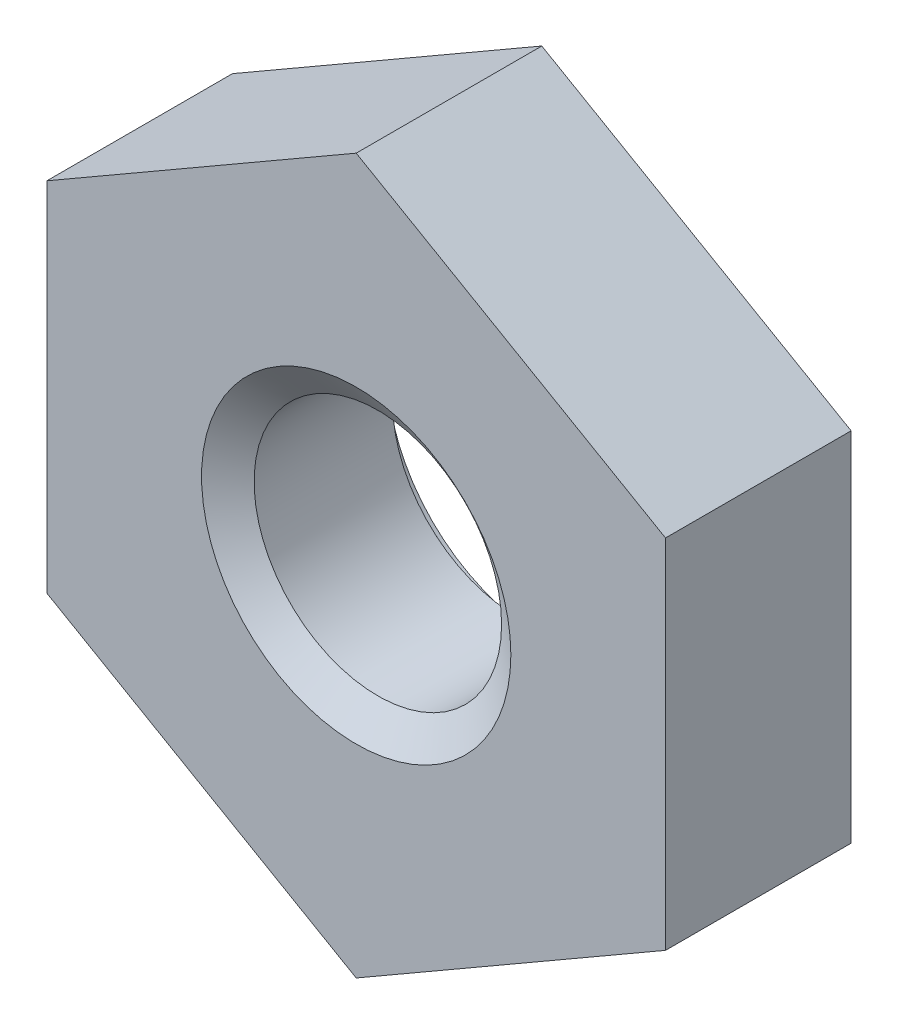
ISO-10303-21;
HEADER;
FILE_DESCRIPTION(('STEP AP214'),'2;1');
FILE_NAME('part.step','',(''),(''),'','','');
FILE_SCHEMA(('AUTOMOTIVE_DESIGN { 1 0 10303 214 1 1 1 1 }'));
ENDSEC;
DATA;
#1=APPLICATION_CONTEXT('core data for automotive mechanical design processes');
#2=APPLICATION_PROTOCOL_DEFINITION('international standard','automotive_design',2000,#1);
#3=PRODUCT_CONTEXT('',#1,'mechanical');
#4=PRODUCT('Part','Part','',(#3));
#5=PRODUCT_RELATED_PRODUCT_CATEGORY('part','',(#4));
#6=PRODUCT_DEFINITION_FORMATION('','',#4);
#7=PRODUCT_DEFINITION_CONTEXT('part definition',#1,'design');
#8=PRODUCT_DEFINITION('design','',#6,#7);
#9=PRODUCT_DEFINITION_SHAPE('','',#8);
#10=(LENGTH_UNIT() NAMED_UNIT(*) SI_UNIT(.MILLI.,.METRE.));
#11=(NAMED_UNIT(*) PLANE_ANGLE_UNIT() SI_UNIT($,.RADIAN.));
#12=(NAMED_UNIT(*) SI_UNIT($,.STERADIAN.) SOLID_ANGLE_UNIT());
#13=UNCERTAINTY_MEASURE_WITH_UNIT(LENGTH_MEASURE(1.E-05),#10,'distance_accuracy_value','');
#14=(GEOMETRIC_REPRESENTATION_CONTEXT(3) GLOBAL_UNCERTAINTY_ASSIGNED_CONTEXT((#13)) GLOBAL_UNIT_ASSIGNED_CONTEXT((#10,
#11,#12)) REPRESENTATION_CONTEXT('',''));
#15=CARTESIAN_POINT('',(0.,0.,0.));
#16=DIRECTION('',(0.,0.,1.));
#17=DIRECTION('',(1.,0.,0.));
#18=AXIS2_PLACEMENT_3D('',#15,#16,#17);
#19=CARTESIAN_POINT('',(0.,0.,-1.2));
#20=DIRECTION('',(0.,0.,1.));
#21=DIRECTION('',(1.,0.,0.));
#22=AXIS2_PLACEMENT_3D('',#19,#20,#21);
#23=CYLINDRICAL_SURFACE('',#22,0.8);
#24=CARTESIAN_POINT('',(0.,0.,-0.140041507641936));
#25=DIRECTION('',(0.,0.,1.));
#26=DIRECTION('',(1.,0.,0.));
#27=AXIS2_PLACEMENT_3D('',#24,#25,#26);
#28=CIRCLE('',#27,0.8);
#29=CARTESIAN_POINT('',(0.8,0.,-0.140041507641936));
#30=VERTEX_POINT('',#29);
#31=EDGE_CURVE('E107',#30,#30,#28,.F.);
#32=ORIENTED_EDGE('',*,*,#31,.F.);
#33=EDGE_LOOP('',(#32));
#34=FACE_BOUND('',#33,.T.);
#35=CARTESIAN_POINT('',(0.,0.,-1.03455849235806));
#36=DIRECTION('',(0.,0.,-1.));
#37=DIRECTION('',(-1.,0.,0.));
#38=AXIS2_PLACEMENT_3D('',#35,#36,#37);
#39=CIRCLE('',#38,0.8);
#40=CARTESIAN_POINT('',(-0.8,0.,-1.03455849235806));
#41=VERTEX_POINT('',#40);
#42=EDGE_CURVE('E36',#41,#41,#39,.F.);
#43=ORIENTED_EDGE('',*,*,#42,.F.);
#44=EDGE_LOOP('',(#43));
#45=FACE_BOUND('',#44,.T.);
#46=ADVANCED_FACE('F32',(#34,#45),#23,.F.);
#47=CARTESIAN_POINT('',(0.,2.30940107675852,-1.2));
#48=DIRECTION('',(0.,0.,-1.));
#49=DIRECTION('',(-1.,0.,0.));
#50=AXIS2_PLACEMENT_3D('',#47,#48,#49);
#51=PLANE('',#50);
#52=DIRECTION('',(-0.86602540378443,-0.500000000000015,0.));
#53=VECTOR('',#52,1.);
#54=CARTESIAN_POINT('',(0.,2.30940107675852,-1.2));
#55=LINE('',#54,#53);
#56=CARTESIAN_POINT('',(0.,2.30940107675852,-1.2));
#57=VERTEX_POINT('',#56);
#58=CARTESIAN_POINT('',(-2.,1.15470053837922,-1.2));
#59=VERTEX_POINT('',#58);
#60=EDGE_CURVE('E88',#57,#59,#55,.T.);
#61=ORIENTED_EDGE('',*,*,#60,.F.);
#62=DIRECTION('',(-0.866025403784437,0.500000000000003,0.));
#63=VECTOR('',#62,1.);
#64=CARTESIAN_POINT('',(2.00000000000001,1.15470053837925,-1.2));
#65=LINE('',#64,#63);
#66=CARTESIAN_POINT('',(2.00000000000001,1.15470053837925,-1.2));
#67=VERTEX_POINT('',#66);
#68=EDGE_CURVE('E93',#67,#57,#65,.T.);
#69=ORIENTED_EDGE('',*,*,#68,.F.);
#70=DIRECTION('',(0.,-1.,0.));
#71=VECTOR('',#70,1.);
#72=CARTESIAN_POINT('',(2.00000000000001,1.15470053837925,-1.2));
#73=LINE('',#72,#71);
#74=CARTESIAN_POINT('',(2.00000000000001,-1.15470053837927,-1.2));
#75=VERTEX_POINT('',#74);
#76=EDGE_CURVE('E132',#67,#75,#73,.T.);
#77=ORIENTED_EDGE('',*,*,#76,.T.);
#78=DIRECTION('',(0.86602540378443,0.500000000000014,0.));
#79=VECTOR('',#78,1.);
#80=CARTESIAN_POINT('',(0.,-2.30940107675856,-1.2));
#81=LINE('',#80,#79);
#82=CARTESIAN_POINT('',(0.,-2.30940107675856,-1.2));
#83=VERTEX_POINT('',#82);
#84=EDGE_CURVE('E129',#83,#75,#81,.T.);
#85=ORIENTED_EDGE('',*,*,#84,.F.);
#86=DIRECTION('',(0.866025403784438,-0.500000000000001,0.));
#87=VECTOR('',#86,1.);
#88=CARTESIAN_POINT('',(-2.,-1.1547005383793,-1.2));
#89=LINE('',#88,#87);
#90=CARTESIAN_POINT('',(-2.,-1.1547005383793,-1.2));
#91=VERTEX_POINT('',#90);
#92=EDGE_CURVE('E126',#91,#83,#89,.T.);
#93=ORIENTED_EDGE('',*,*,#92,.F.);
#94=DIRECTION('',(0.,-1.,0.));
#95=VECTOR('',#94,1.);
#96=CARTESIAN_POINT('',(-2.,1.15470053837922,-1.2));
#97=LINE('',#96,#95);
#98=EDGE_CURVE('E124',#59,#91,#97,.T.);
#99=ORIENTED_EDGE('',*,*,#98,.F.);
#100=EDGE_LOOP('',(#61,#69,#77,#85,#93,#99));
#101=FACE_BOUND('',#100,.T.);
#102=CARTESIAN_POINT('',(0.,0.,-1.2));
#103=DIRECTION('',(0.,0.,-1.));
#104=DIRECTION('',(-1.,0.,0.));
#105=AXIS2_PLACEMENT_3D('',#102,#103,#104);
#106=CIRCLE('',#105,0.999999999999999);
#107=CARTESIAN_POINT('',(-0.999999999999999,0.,-1.2));
#108=VERTEX_POINT('',#107);
#109=EDGE_CURVE('E140',#108,#108,#106,.F.);
#110=ORIENTED_EDGE('',*,*,#109,.T.);
#111=EDGE_LOOP('',(#110));
#112=FACE_BOUND('',#111,.T.);
#113=ADVANCED_FACE('F159',(#101,#112),#51,.T.);
#114=CARTESIAN_POINT('',(0.,2.30940107675852,0.));
#115=DIRECTION('',(0.,0.,-1.));
#116=DIRECTION('',(-1.,0.,0.));
#117=AXIS2_PLACEMENT_3D('',#114,#115,#116);
#118=PLANE('',#117);
#119=DIRECTION('',(-0.86602540378443,-0.500000000000015,0.));
#120=VECTOR('',#119,1.);
#121=CARTESIAN_POINT('',(0.,2.30940107675852,0.));
#122=LINE('',#121,#120);
#123=CARTESIAN_POINT('',(0.,2.30940107675852,0.));
#124=VERTEX_POINT('',#123);
#125=CARTESIAN_POINT('',(-2.,1.15470053837922,0.));
#126=VERTEX_POINT('',#125);
#127=EDGE_CURVE('E86',#124,#126,#122,.T.);
#128=ORIENTED_EDGE('',*,*,#127,.T.);
#129=DIRECTION('',(0.,-1.,0.));
#130=VECTOR('',#129,1.);
#131=CARTESIAN_POINT('',(-2.,1.15470053837922,0.));
#132=LINE('',#131,#130);
#133=CARTESIAN_POINT('',(-2.,-1.1547005383793,0.));
#134=VERTEX_POINT('',#133);
#135=EDGE_CURVE('E96',#126,#134,#132,.T.);
#136=ORIENTED_EDGE('',*,*,#135,.T.);
#137=DIRECTION('',(0.866025403784438,-0.500000000000001,0.));
#138=VECTOR('',#137,1.);
#139=CARTESIAN_POINT('',(-2.,-1.1547005383793,0.));
#140=LINE('',#139,#138);
#141=CARTESIAN_POINT('',(0.,-2.30940107675856,0.));
#142=VERTEX_POINT('',#141);
#143=EDGE_CURVE('E101',#134,#142,#140,.T.);
#144=ORIENTED_EDGE('',*,*,#143,.T.);
#145=DIRECTION('',(0.86602540378443,0.500000000000014,0.));
#146=VECTOR('',#145,1.);
#147=CARTESIAN_POINT('',(0.,-2.30940107675856,0.));
#148=LINE('',#147,#146);
#149=CARTESIAN_POINT('',(2.00000000000001,-1.15470053837927,0.));
#150=VERTEX_POINT('',#149);
#151=EDGE_CURVE('E116',#142,#150,#148,.T.);
#152=ORIENTED_EDGE('',*,*,#151,.T.);
#153=DIRECTION('',(0.,-1.,0.));
#154=VECTOR('',#153,1.);
#155=CARTESIAN_POINT('',(2.00000000000001,1.15470053837925,0.));
#156=LINE('',#155,#154);
#157=CARTESIAN_POINT('',(2.00000000000001,1.15470053837925,0.));
#158=VERTEX_POINT('',#157);
#159=EDGE_CURVE('E119',#158,#150,#156,.T.);
#160=ORIENTED_EDGE('',*,*,#159,.F.);
#161=DIRECTION('',(-0.866025403784437,0.500000000000003,0.));
#162=VECTOR('',#161,1.);
#163=CARTESIAN_POINT('',(2.00000000000001,1.15470053837925,0.));
#164=LINE('',#163,#162);
#165=EDGE_CURVE('E106',#158,#124,#164,.T.);
#166=ORIENTED_EDGE('',*,*,#165,.T.);
#167=EDGE_LOOP('',(#128,#136,#144,#152,#160,#166));
#168=FACE_BOUND('',#167,.T.);
#169=CARTESIAN_POINT('',(0.,0.,0.));
#170=DIRECTION('',(0.,0.,1.));
#171=DIRECTION('',(1.,0.,0.));
#172=AXIS2_PLACEMENT_3D('',#169,#170,#171);
#173=CIRCLE('',#172,0.999999999999999);
#174=CARTESIAN_POINT('',(0.999999999999999,0.,0.));
#175=VERTEX_POINT('',#174);
#176=EDGE_CURVE('E110',#175,#175,#173,.T.);
#177=ORIENTED_EDGE('',*,*,#176,.F.);
#178=EDGE_LOOP('',(#177));
#179=FACE_BOUND('',#178,.T.);
#180=ADVANCED_FACE('F103',(#168,#179),#118,.F.);
#181=CARTESIAN_POINT('',(0.,2.30940107675852,-1.2));
#182=DIRECTION('',(-0.500000000000015,0.86602540378443,0.));
#183=DIRECTION('',(-0.86602540378443,-0.500000000000015,0.));
#184=AXIS2_PLACEMENT_3D('',#181,#182,#183);
#185=PLANE('',#184);
#186=ORIENTED_EDGE('',*,*,#127,.F.);
#187=DIRECTION('',(0.,0.,1.));
#188=VECTOR('',#187,1.);
#189=CARTESIAN_POINT('',(0.,2.30940107675852,-1.2));
#190=LINE('',#189,#188);
#191=EDGE_CURVE('E11',#57,#124,#190,.T.);
#192=ORIENTED_EDGE('',*,*,#191,.F.);
#193=ORIENTED_EDGE('',*,*,#60,.T.);
#194=DIRECTION('',(0.,0.,1.));
#195=VECTOR('',#194,1.);
#196=CARTESIAN_POINT('',(-2.,1.15470053837922,-1.2));
#197=LINE('',#196,#195);
#198=EDGE_CURVE('E83',#59,#126,#197,.T.);
#199=ORIENTED_EDGE('',*,*,#198,.T.);
#200=EDGE_LOOP('',(#186,#192,#193,#199));
#201=FACE_BOUND('',#200,.T.);
#202=ADVANCED_FACE('F34',(#201),#185,.T.);
#203=CARTESIAN_POINT('',(2.00000000000001,1.15470053837925,-1.2));
#204=DIRECTION('',(0.500000000000003,0.866025403784437,0.));
#205=DIRECTION('',(-0.866025403784437,0.500000000000003,0.));
#206=AXIS2_PLACEMENT_3D('',#203,#204,#205);
#207=PLANE('',#206);
#208=ORIENTED_EDGE('',*,*,#165,.F.);
#209=DIRECTION('',(0.,0.,1.));
#210=VECTOR('',#209,1.);
#211=CARTESIAN_POINT('',(2.00000000000001,1.15470053837925,-1.2));
#212=LINE('',#211,#210);
#213=EDGE_CURVE('E41',#67,#158,#212,.T.);
#214=ORIENTED_EDGE('',*,*,#213,.F.);
#215=ORIENTED_EDGE('',*,*,#68,.T.);
#216=ORIENTED_EDGE('',*,*,#191,.T.);
#217=EDGE_LOOP('',(#208,#214,#215,#216));
#218=FACE_BOUND('',#217,.T.);
#219=ADVANCED_FACE('F173',(#218),#207,.T.);
#220=CARTESIAN_POINT('',(2.00000000000001,1.15470053837925,-1.2));
#221=DIRECTION('',(-1.,0.,0.));
#222=DIRECTION('',(0.,0.,1.));
#223=AXIS2_PLACEMENT_3D('',#220,#221,#222);
#224=PLANE('',#223);
#225=ORIENTED_EDGE('',*,*,#159,.T.);
#226=DIRECTION('',(0.,0.,1.));
#227=VECTOR('',#226,1.);
#228=CARTESIAN_POINT('',(2.00000000000001,-1.15470053837927,-1.2));
#229=LINE('',#228,#227);
#230=EDGE_CURVE('E136',#75,#150,#229,.T.);
#231=ORIENTED_EDGE('',*,*,#230,.F.);
#232=ORIENTED_EDGE('',*,*,#76,.F.);
#233=ORIENTED_EDGE('',*,*,#213,.T.);
#234=EDGE_LOOP('',(#225,#231,#232,#233));
#235=FACE_BOUND('',#234,.T.);
#236=ADVANCED_FACE('F176',(#235),#224,.F.);
#237=CARTESIAN_POINT('',(0.,-2.30940107675856,-1.2));
#238=DIRECTION('',(0.500000000000014,-0.86602540378443,0.));
#239=DIRECTION('',(0.86602540378443,0.500000000000014,0.));
#240=AXIS2_PLACEMENT_3D('',#237,#238,#239);
#241=PLANE('',#240);
#242=ORIENTED_EDGE('',*,*,#151,.F.);
#243=DIRECTION('',(0.,0.,1.));
#244=VECTOR('',#243,1.);
#245=CARTESIAN_POINT('',(0.,-2.30940107675856,-1.2));
#246=LINE('',#245,#244);
#247=EDGE_CURVE('E138',#83,#142,#246,.T.);
#248=ORIENTED_EDGE('',*,*,#247,.F.);
#249=ORIENTED_EDGE('',*,*,#84,.T.);
#250=ORIENTED_EDGE('',*,*,#230,.T.);
#251=EDGE_LOOP('',(#242,#248,#249,#250));
#252=FACE_BOUND('',#251,.T.);
#253=ADVANCED_FACE('F179',(#252),#241,.T.);
#254=CARTESIAN_POINT('',(-2.,-1.1547005383793,-1.2));
#255=DIRECTION('',(-0.500000000000001,-0.866025403784438,0.));
#256=DIRECTION('',(0.866025403784438,-0.500000000000001,0.));
#257=AXIS2_PLACEMENT_3D('',#254,#255,#256);
#258=PLANE('',#257);
#259=ORIENTED_EDGE('',*,*,#143,.F.);
#260=DIRECTION('',(0.,0.,1.));
#261=VECTOR('',#260,1.);
#262=CARTESIAN_POINT('',(-2.,-1.1547005383793,-1.2));
#263=LINE('',#262,#261);
#264=EDGE_CURVE('E92',#91,#134,#263,.T.);
#265=ORIENTED_EDGE('',*,*,#264,.F.);
#266=ORIENTED_EDGE('',*,*,#92,.T.);
#267=ORIENTED_EDGE('',*,*,#247,.T.);
#268=EDGE_LOOP('',(#259,#265,#266,#267));
#269=FACE_BOUND('',#268,.T.);
#270=ADVANCED_FACE('F183',(#269),#258,.T.);
#271=CARTESIAN_POINT('',(-2.,1.15470053837922,-1.2));
#272=DIRECTION('',(-1.,0.,0.));
#273=DIRECTION('',(0.,0.,1.));
#274=AXIS2_PLACEMENT_3D('',#271,#272,#273);
#275=PLANE('',#274);
#276=ORIENTED_EDGE('',*,*,#135,.F.);
#277=ORIENTED_EDGE('',*,*,#198,.F.);
#278=ORIENTED_EDGE('',*,*,#98,.T.);
#279=ORIENTED_EDGE('',*,*,#264,.T.);
#280=EDGE_LOOP('',(#276,#277,#278,#279));
#281=FACE_BOUND('',#280,.T.);
#282=ADVANCED_FACE('F97',(#281),#275,.T.);
#283=CARTESIAN_POINT('',(0.,0.,-0.15404565840613));
#284=DIRECTION('',(0.,0.,1.));
#285=DIRECTION('',(1.,0.,0.));
#286=AXIS2_PLACEMENT_3D('',#283,#284,#285);
#287=CONICAL_SURFACE('',#286,0.779999999999999,0.959931088596899);
#288=ORIENTED_EDGE('',*,*,#176,.T.);
#289=EDGE_LOOP('',(#288));
#290=FACE_BOUND('',#289,.T.);
#291=ORIENTED_EDGE('',*,*,#31,.T.);
#292=EDGE_LOOP('',(#291));
#293=FACE_BOUND('',#292,.T.);
#294=ADVANCED_FACE('F154',(#290,#293),#287,.F.);
#295=CARTESIAN_POINT('',(0.,0.,-1.1746));
#296=DIRECTION('',(0.,0.,-1.));
#297=DIRECTION('',(-1.,0.,0.));
#298=AXIS2_PLACEMENT_3D('',#295,#296,#297);
#299=CONICAL_SURFACE('',#298,0.999999999999999,0.959931088596885);
#300=CARTESIAN_POINT('',(0.,0.,-1.1746));
#301=DIRECTION('',(0.,0.,1.));
#302=DIRECTION('',(1.,0.,0.));
#303=AXIS2_PLACEMENT_3D('',#300,#301,#302);
#304=CIRCLE('',#303,0.999999999999999);
#305=CARTESIAN_POINT('',(0.999999999999999,0.,-1.1746));
#306=VERTEX_POINT('',#305);
#307=EDGE_CURVE('E142',#306,#306,#304,.T.);
#308=ORIENTED_EDGE('',*,*,#307,.F.);
#309=EDGE_LOOP('',(#308));
#310=FACE_BOUND('',#309,.T.);
#311=ORIENTED_EDGE('',*,*,#42,.T.);
#312=EDGE_LOOP('',(#311));
#313=FACE_BOUND('',#312,.T.);
#314=ADVANCED_FACE('F151',(#310,#313),#299,.F.);
#315=CARTESIAN_POINT('',(0.,0.,-25.0375057290932));
#316=DIRECTION('',(0.,0.,1.));
#317=DIRECTION('',(1.,0.,0.));
#318=AXIS2_PLACEMENT_3D('',#315,#316,#317);
#319=CYLINDRICAL_SURFACE('',#318,0.999999999999999);
#320=ORIENTED_EDGE('',*,*,#109,.F.);
#321=EDGE_LOOP('',(#320));
#322=FACE_BOUND('',#321,.T.);
#323=ORIENTED_EDGE('',*,*,#307,.T.);
#324=EDGE_LOOP('',(#323));
#325=FACE_BOUND('',#324,.T.);
#326=ADVANCED_FACE('F149',(#322,#325),#319,.F.);
#327=CLOSED_SHELL('',(#46,#113,#180,#202,#219,#236,#253,#270,#282,#294,#314,#326));
#328=MANIFOLD_SOLID_BREP('B2',#327);
#329=ADVANCED_BREP_SHAPE_REPRESENTATION('',(#18,#328),#14);
#330=SHAPE_DEFINITION_REPRESENTATION(#9,#329);
ENDSEC;
END-ISO-10303-21;
